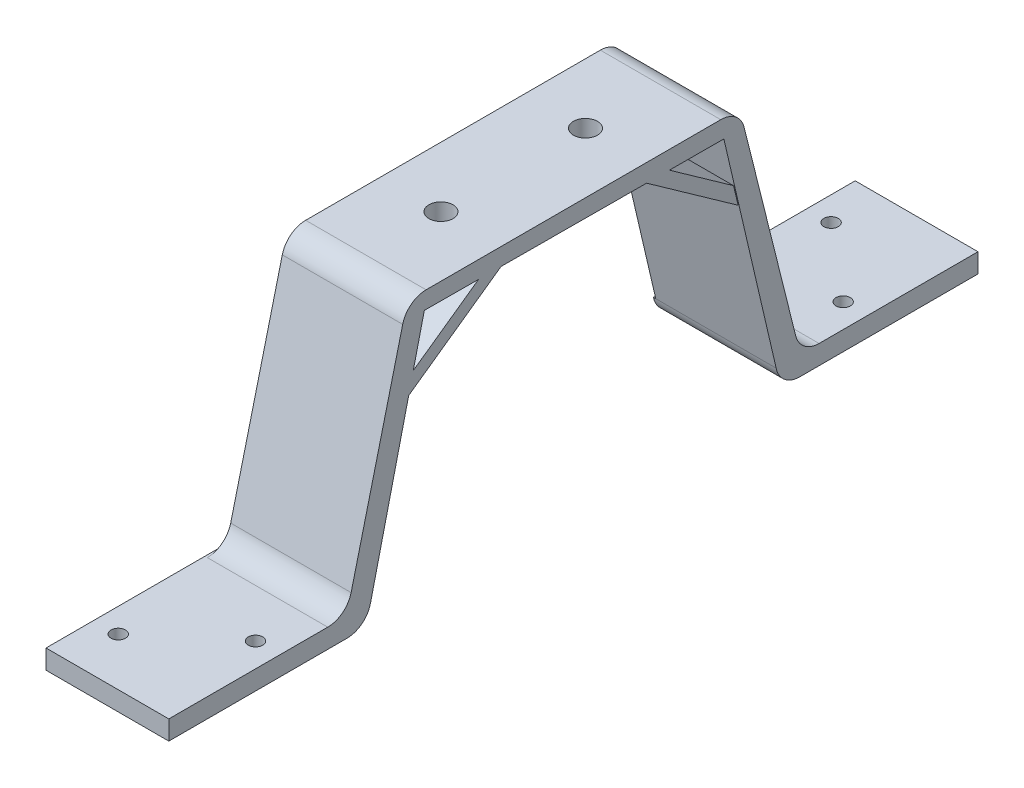
ISO-10303-21;
HEADER;
FILE_DESCRIPTION(('STEP AP214'),'2;1');
FILE_NAME('part.step','',(''),(''),'','','');
FILE_SCHEMA(('AUTOMOTIVE_DESIGN { 1 0 10303 214 1 1 1 1 }'));
ENDSEC;
DATA;
#1=APPLICATION_CONTEXT('core data for automotive mechanical design processes');
#2=APPLICATION_PROTOCOL_DEFINITION('international standard','automotive_design',2000,#1);
#3=PRODUCT_CONTEXT('',#1,'mechanical');
#4=PRODUCT('Part','Part','',(#3));
#5=PRODUCT_RELATED_PRODUCT_CATEGORY('part','',(#4));
#6=PRODUCT_DEFINITION_FORMATION('','',#4);
#7=PRODUCT_DEFINITION_CONTEXT('part definition',#1,'design');
#8=PRODUCT_DEFINITION('design','',#6,#7);
#9=PRODUCT_DEFINITION_SHAPE('','',#8);
#10=(LENGTH_UNIT() NAMED_UNIT(*) SI_UNIT(.MILLI.,.METRE.));
#11=(NAMED_UNIT(*) PLANE_ANGLE_UNIT() SI_UNIT($,.RADIAN.));
#12=(NAMED_UNIT(*) SI_UNIT($,.STERADIAN.) SOLID_ANGLE_UNIT());
#13=UNCERTAINTY_MEASURE_WITH_UNIT(LENGTH_MEASURE(1.E-05),#10,'distance_accuracy_value','');
#14=(GEOMETRIC_REPRESENTATION_CONTEXT(3) GLOBAL_UNCERTAINTY_ASSIGNED_CONTEXT((#13)) GLOBAL_UNIT_ASSIGNED_CONTEXT((#10,
#11,#12)) REPRESENTATION_CONTEXT('',''));
#15=CARTESIAN_POINT('',(0.,0.,0.));
#16=DIRECTION('',(0.,0.,1.));
#17=DIRECTION('',(1.,0.,0.));
#18=AXIS2_PLACEMENT_3D('',#15,#16,#17);
#19=CARTESIAN_POINT('',(25.5,4.,0.));
#20=DIRECTION('',(0.,-1.,0.));
#21=DIRECTION('',(0.,0.,-1.));
#22=AXIS2_PLACEMENT_3D('',#19,#20,#21);
#23=PLANE('',#22);
#24=CARTESIAN_POINT('',(20.5,3.99999999999998,145.004531802838));
#25=DIRECTION('',(0.,-1.,0.));
#26=DIRECTION('',(0.,0.,-1.));
#27=AXIS2_PLACEMENT_3D('',#24,#25,#26);
#28=CIRCLE('',#27,1.5);
#29=CARTESIAN_POINT('',(20.5,3.99999999999998,143.504531802838));
#30=VERTEX_POINT('',#29);
#31=EDGE_CURVE('E504',#30,#30,#28,.T.);
#32=ORIENTED_EDGE('',*,*,#31,.T.);
#33=EDGE_LOOP('',(#32));
#34=FACE_BOUND('',#33,.T.);
#35=CARTESIAN_POINT('',(5.,3.99999999999998,158.));
#36=DIRECTION('',(0.,-1.,0.));
#37=DIRECTION('',(0.,0.,-1.));
#38=AXIS2_PLACEMENT_3D('',#35,#36,#37);
#39=CIRCLE('',#38,1.49999999999999);
#40=CARTESIAN_POINT('',(5.,3.99999999999998,156.5));
#41=VERTEX_POINT('',#40);
#42=EDGE_CURVE('E500',#41,#41,#39,.T.);
#43=ORIENTED_EDGE('',*,*,#42,.T.);
#44=EDGE_LOOP('',(#43));
#45=FACE_BOUND('',#44,.T.);
#46=DIRECTION('',(0.,0.,1.));
#47=VECTOR('',#46,1.);
#48=CARTESIAN_POINT('',(25.5,4.,0.));
#49=LINE('',#48,#47);
#50=CARTESIAN_POINT('',(25.5,3.99999999999998,135.004531802838));
#51=VERTEX_POINT('',#50);
#52=CARTESIAN_POINT('',(25.5,3.99999999999998,168.));
#53=VERTEX_POINT('',#52);
#54=EDGE_CURVE('E368',#51,#53,#49,.T.);
#55=ORIENTED_EDGE('',*,*,#54,.F.);
#56=DIRECTION('',(1.,0.,0.));
#57=VECTOR('',#56,1.);
#58=CARTESIAN_POINT('',(0.499999999999997,3.99999999999998,135.004531802838));
#59=LINE('',#58,#57);
#60=CARTESIAN_POINT('',(0.499999999999997,3.99999999999998,135.004531802838));
#61=VERTEX_POINT('',#60);
#62=EDGE_CURVE('E441',#51,#61,#59,.F.);
#63=ORIENTED_EDGE('',*,*,#62,.T.);
#64=DIRECTION('',(0.,0.,-1.));
#65=VECTOR('',#64,1.);
#66=CARTESIAN_POINT('',(0.499999999999997,3.99999999999998,131.1));
#67=LINE('',#66,#65);
#68=CARTESIAN_POINT('',(0.499999999999997,3.99999999999998,126.1));
#69=VERTEX_POINT('',#68);
#70=EDGE_CURVE('E310',#61,#69,#67,.T.);
#71=ORIENTED_EDGE('',*,*,#70,.T.);
#72=DIRECTION('',(1.,0.,0.));
#73=VECTOR('',#72,1.);
#74=CARTESIAN_POINT('',(-0.5,3.99999999999998,126.1));
#75=LINE('',#74,#73);
#76=CARTESIAN_POINT('',(0.,3.99999999999998,126.1));
#77=VERTEX_POINT('',#76);
#78=EDGE_CURVE('E519',#77,#69,#75,.T.);
#79=ORIENTED_EDGE('',*,*,#78,.F.);
#80=DIRECTION('',(0.,0.,1.));
#81=VECTOR('',#80,1.);
#82=CARTESIAN_POINT('',(0.,4.,0.));
#83=LINE('',#82,#81);
#84=CARTESIAN_POINT('',(0.,3.99999999999998,168.));
#85=VERTEX_POINT('',#84);
#86=EDGE_CURVE('E386',#77,#85,#83,.T.);
#87=ORIENTED_EDGE('',*,*,#86,.T.);
#88=DIRECTION('',(-1.,0.,0.));
#89=VECTOR('',#88,1.);
#90=CARTESIAN_POINT('',(25.5,3.99999999999998,168.));
#91=LINE('',#90,#89);
#92=EDGE_CURVE('E405',#53,#85,#91,.T.);
#93=ORIENTED_EDGE('',*,*,#92,.F.);
#94=EDGE_LOOP('',(#55,#63,#71,#79,#87,#93));
#95=FACE_BOUND('',#94,.T.);
#96=ADVANCED_FACE('F42',(#34,#45,#95),#23,.F.);
#97=CARTESIAN_POINT('',(25.5,0.,0.));
#98=DIRECTION('',(0.,1.,0.));
#99=DIRECTION('',(0.,0.,1.));
#100=AXIS2_PLACEMENT_3D('',#97,#98,#99);
#101=PLANE('',#100);
#102=CARTESIAN_POINT('',(20.5,0.,145.004531802838));
#103=DIRECTION('',(0.,1.,0.));
#104=DIRECTION('',(0.,0.,1.));
#105=AXIS2_PLACEMENT_3D('',#102,#103,#104);
#106=CIRCLE('',#105,1.5);
#107=CARTESIAN_POINT('',(20.5,0.,146.504531802838));
#108=VERTEX_POINT('',#107);
#109=EDGE_CURVE('E501',#108,#108,#106,.T.);
#110=ORIENTED_EDGE('',*,*,#109,.T.);
#111=EDGE_LOOP('',(#110));
#112=FACE_BOUND('',#111,.T.);
#113=CARTESIAN_POINT('',(5.,0.,158.));
#114=DIRECTION('',(0.,1.,0.));
#115=DIRECTION('',(0.,0.,1.));
#116=AXIS2_PLACEMENT_3D('',#113,#114,#115);
#117=CIRCLE('',#116,1.49999999999999);
#118=CARTESIAN_POINT('',(5.,0.,159.5));
#119=VERTEX_POINT('',#118);
#120=EDGE_CURVE('E496',#119,#119,#117,.T.);
#121=ORIENTED_EDGE('',*,*,#120,.T.);
#122=EDGE_LOOP('',(#121));
#123=FACE_BOUND('',#122,.T.);
#124=DIRECTION('',(0.,0.,-1.));
#125=VECTOR('',#124,1.);
#126=CARTESIAN_POINT('',(0.,0.,0.));
#127=LINE('',#126,#125);
#128=CARTESIAN_POINT('',(0.,0.,168.));
#129=VERTEX_POINT('',#128);
#130=CARTESIAN_POINT('',(0.,0.,130.998979485566));
#131=VERTEX_POINT('',#130);
#132=EDGE_CURVE('E369',#129,#131,#127,.T.);
#133=ORIENTED_EDGE('',*,*,#132,.T.);
#134=DIRECTION('',(1.,0.,0.));
#135=VECTOR('',#134,1.);
#136=CARTESIAN_POINT('',(25.5,0.,130.998979485566));
#137=LINE('',#136,#135);
#138=CARTESIAN_POINT('',(25.5,0.,130.998979485566));
#139=VERTEX_POINT('',#138);
#140=EDGE_CURVE('E413',#131,#139,#137,.T.);
#141=ORIENTED_EDGE('',*,*,#140,.T.);
#142=DIRECTION('',(0.,0.,-1.));
#143=VECTOR('',#142,1.);
#144=CARTESIAN_POINT('',(25.5,0.,0.));
#145=LINE('',#144,#143);
#146=CARTESIAN_POINT('',(25.5,0.,168.));
#147=VERTEX_POINT('',#146);
#148=EDGE_CURVE('E378',#147,#139,#145,.T.);
#149=ORIENTED_EDGE('',*,*,#148,.F.);
#150=DIRECTION('',(-1.,0.,0.));
#151=VECTOR('',#150,1.);
#152=CARTESIAN_POINT('',(25.5,0.,168.));
#153=LINE('',#152,#151);
#154=EDGE_CURVE('E401',#147,#129,#153,.T.);
#155=ORIENTED_EDGE('',*,*,#154,.T.);
#156=EDGE_LOOP('',(#133,#141,#149,#155));
#157=FACE_BOUND('',#156,.T.);
#158=ADVANCED_FACE('F662',(#112,#123,#157),#101,.F.);
#159=CARTESIAN_POINT('',(0.,0.,0.));
#160=DIRECTION('',(1.,0.,0.));
#161=DIRECTION('',(0.,0.,-1.));
#162=AXIS2_PLACEMENT_3D('',#159,#160,#161);
#163=PLANE('',#162);
#164=ORIENTED_EDGE('',*,*,#86,.F.);
#165=CARTESIAN_POINT('',(0.,4.99999999999998,130.998979485566));
#166=DIRECTION('',(1.,0.,0.));
#167=DIRECTION('',(0.,0.,-1.));
#168=AXIS2_PLACEMENT_3D('',#165,#166,#167);
#169=CIRCLE('',#168,5.);
#170=EDGE_CURVE('E420',#77,#131,#169,.F.);
#171=ORIENTED_EDGE('',*,*,#170,.T.);
#172=ORIENTED_EDGE('',*,*,#132,.F.);
#173=DIRECTION('',(0.,-1.,0.));
#174=VECTOR('',#173,1.);
#175=CARTESIAN_POINT('',(0.,0.,168.));
#176=LINE('',#175,#174);
#177=EDGE_CURVE('E391',#85,#129,#176,.T.);
#178=ORIENTED_EDGE('',*,*,#177,.F.);
#179=EDGE_LOOP('',(#164,#171,#172,#178));
#180=FACE_BOUND('',#179,.T.);
#181=ADVANCED_FACE('F674',(#180),#163,.F.);
#182=CARTESIAN_POINT('',(0.499999999999997,50.9238936782228,114.950805331162));
#183=DIRECTION('',(0.,-0.999990946630495,0.00425519177550892));
#184=DIRECTION('',(0.,-0.00425519177550892,-0.999990946630495));
#185=AXIS2_PLACEMENT_3D('',#182,#183,#184);
#186=PLANE('',#185);
#187=CARTESIAN_POINT('',(13.,50.7283624190828,69.));
#188=DIRECTION('',(0.,-0.999990946630495,0.00425519177550892));
#189=DIRECTION('',(0.,0.00425519177550892,0.999990946630495));
#190=AXIS2_PLACEMENT_3D('',#187,#188,#189);
#191=ELLIPSE('',#190,2.50002263362867,2.5);
#192=CARTESIAN_POINT('',(15.4920486977899,50.7275146421288,68.800768255934));
#193=VERTEX_POINT('',#192);
#194=CARTESIAN_POINT('',(10.5079513022101,50.7275146421288,68.800768255934));
#195=VERTEX_POINT('',#194);
#196=EDGE_CURVE('E63',#193,#195,#191,.T.);
#197=ORIENTED_EDGE('',*,*,#196,.F.);
#198=DIRECTION('',(-1.,0.,0.));
#199=VECTOR('',#198,1.);
#200=CARTESIAN_POINT('',(0.499999999999997,50.7275146421288,68.800768255934));
#201=LINE('',#200,#199);
#202=CARTESIAN_POINT('',(25.5,50.7275146421288,68.800768255934));
#203=VERTEX_POINT('',#202);
#204=EDGE_CURVE('E241',#203,#193,#201,.T.);
#205=ORIENTED_EDGE('',*,*,#204,.F.);
#206=DIRECTION('',(0.,-0.00425519177550892,-0.999990946630495));
#207=VECTOR('',#206,1.);
#208=CARTESIAN_POINT('',(25.5,50.9238936782228,114.950805331162));
#209=LINE('',#208,#207);
#210=CARTESIAN_POINT('',(25.5,50.8560956628605,99.0179390495462));
#211=VERTEX_POINT('',#210);
#212=EDGE_CURVE('E347',#211,#203,#209,.T.);
#213=ORIENTED_EDGE('',*,*,#212,.F.);
#214=DIRECTION('',(1.,0.,0.));
#215=VECTOR('',#214,1.);
#216=CARTESIAN_POINT('',(0.499999999999997,50.8560956628605,99.0179390495462));
#217=LINE('',#216,#215);
#218=CARTESIAN_POINT('',(15.4999356372718,50.8560956628605,99.0179390495462));
#219=VERTEX_POINT('',#218);
#220=EDGE_CURVE('E280',#219,#211,#217,.T.);
#221=ORIENTED_EDGE('',*,*,#220,.F.);
#222=CARTESIAN_POINT('',(13.,50.8560193280733,99.));
#223=DIRECTION('',(0.,-0.999990946630495,0.00425519177550892));
#224=DIRECTION('',(0.,0.00425519177550892,0.999990946630495));
#225=AXIS2_PLACEMENT_3D('',#222,#223,#224);
#226=ELLIPSE('',#225,2.50002263362867,2.5);
#227=CARTESIAN_POINT('',(10.5000643627282,50.8560956628605,99.0179390495462));
#228=VERTEX_POINT('',#227);
#229=EDGE_CURVE('E56',#228,#219,#226,.T.);
#230=ORIENTED_EDGE('',*,*,#229,.F.);
#231=CARTESIAN_POINT('',(0.499999999999997,50.8560956628605,99.0179390495462));
#232=VERTEX_POINT('',#231);
#233=EDGE_CURVE('E275',#232,#228,#217,.T.);
#234=ORIENTED_EDGE('',*,*,#233,.F.);
#235=DIRECTION('',(0.,-0.00425519177550892,-0.999990946630495));
#236=VECTOR('',#235,1.);
#237=CARTESIAN_POINT('',(0.499999999999997,50.9238936782228,114.950805331162));
#238=LINE('',#237,#236);
#239=CARTESIAN_POINT('',(0.499999999999997,50.7275146421288,68.800768255934));
#240=VERTEX_POINT('',#239);
#241=EDGE_CURVE('E323',#232,#240,#238,.T.);
#242=ORIENTED_EDGE('',*,*,#241,.T.);
#243=EDGE_CURVE('E244',#195,#240,#201,.T.);
#244=ORIENTED_EDGE('',*,*,#243,.F.);
#245=EDGE_LOOP('',(#197,#205,#213,#221,#230,#234,#242,#244));
#246=FACE_BOUND('',#245,.T.);
#247=ADVANCED_FACE('F239',(#246),#186,.T.);
#248=DIRECTION('',(1.,0.,0.));
#249=VECTOR('',#248,1.);
#250=CARTESIAN_POINT('',(0.499999999999997,50.7074397662026,64.083073909822));
#251=LINE('',#250,#249);
#252=CARTESIAN_POINT('',(0.499999999999997,50.7074397662027,64.0830739098221));
#253=VERTEX_POINT('',#252);
#254=CARTESIAN_POINT('',(25.5,50.7074397662027,64.0830739098222));
#255=VERTEX_POINT('',#254);
#256=EDGE_CURVE('E259',#253,#255,#251,.T.);
#257=ORIENTED_EDGE('',*,*,#256,.F.);
#258=CARTESIAN_POINT('',(0.499999999999997,50.6592778388253,52.7647846550834));
#259=VERTEX_POINT('',#258);
#260=EDGE_CURVE('E318',#253,#259,#238,.T.);
#261=ORIENTED_EDGE('',*,*,#260,.T.);
#262=DIRECTION('',(1.,0.,0.));
#263=VECTOR('',#262,1.);
#264=CARTESIAN_POINT('',(0.499999999999997,50.6592778388253,52.7647846550834));
#265=LINE('',#264,#263);
#266=CARTESIAN_POINT('',(25.5,50.6592778388253,52.7647846550834));
#267=VERTEX_POINT('',#266);
#268=EDGE_CURVE('E348',#259,#267,#265,.T.);
#269=ORIENTED_EDGE('',*,*,#268,.T.);
#270=EDGE_CURVE('E343',#255,#267,#209,.T.);
#271=ORIENTED_EDGE('',*,*,#270,.F.);
#272=EDGE_LOOP('',(#257,#261,#269,#271));
#273=FACE_BOUND('',#272,.T.);
#274=ADVANCED_FACE('F567',(#273),#186,.T.);
#275=CARTESIAN_POINT('',(0.499999999999997,3.99999999999998,126.1));
#276=DIRECTION('',(0.,-0.231166048016753,-0.97291431187146));
#277=DIRECTION('',(0.,0.97291431187146,-0.231166048016753));
#278=AXIS2_PLACEMENT_3D('',#275,#276,#277);
#279=PLANE('',#278);
#280=DIRECTION('',(1.,0.,0.));
#281=VECTOR('',#280,1.);
#282=CARTESIAN_POINT('',(0.499999999999997,37.2517881460241,118.199320195608));
#283=LINE('',#282,#281);
#284=CARTESIAN_POINT('',(0.499999999999997,37.2517881460241,118.199320195608));
#285=VERTEX_POINT('',#284);
#286=CARTESIAN_POINT('',(25.5,37.2517881460241,118.199320195608));
#287=VERTEX_POINT('',#286);
#288=EDGE_CURVE('E281',#285,#287,#283,.T.);
#289=ORIENTED_EDGE('',*,*,#288,.T.);
#290=DIRECTION('',(0.,0.97291431187146,-0.231166048016753));
#291=VECTOR('',#290,1.);
#292=CARTESIAN_POINT('',(25.5,3.99999999999998,126.1));
#293=LINE('',#292,#291);
#294=CARTESIAN_POINT('',(25.5,3.99999999999998,126.1));
#295=VERTEX_POINT('',#294);
#296=EDGE_CURVE('E339',#295,#287,#293,.T.);
#297=ORIENTED_EDGE('',*,*,#296,.F.);
#298=DIRECTION('',(1.,0.,0.));
#299=VECTOR('',#298,1.);
#300=CARTESIAN_POINT('',(0.499999999999997,3.99999999999998,126.1));
#301=LINE('',#300,#299);
#302=EDGE_CURVE('E357',#69,#295,#301,.T.);
#303=ORIENTED_EDGE('',*,*,#302,.F.);
#304=DIRECTION('',(0.,0.97291431187146,-0.231166048016753));
#305=VECTOR('',#304,1.);
#306=CARTESIAN_POINT('',(0.499999999999997,3.99999999999998,126.1));
#307=LINE('',#306,#305);
#308=EDGE_CURVE('E315',#69,#285,#307,.T.);
#309=ORIENTED_EDGE('',*,*,#308,.T.);
#310=EDGE_LOOP('',(#289,#297,#303,#309));
#311=FACE_BOUND('',#310,.T.);
#312=ADVANCED_FACE('F670',(#311),#279,.T.);
#313=CARTESIAN_POINT('',(25.5,0.,0.));
#314=DIRECTION('',(0.,0.,1.));
#315=DIRECTION('',(1.,0.,0.));
#316=AXIS2_PLACEMENT_3D('',#313,#314,#315);
#317=PLANE('',#316);
#318=DIRECTION('',(0.,1.,0.));
#319=VECTOR('',#318,1.);
#320=CARTESIAN_POINT('',(0.,0.,0.));
#321=LINE('',#320,#319);
#322=CARTESIAN_POINT('',(0.,0.,0.));
#323=VERTEX_POINT('',#322);
#324=CARTESIAN_POINT('',(0.,4.,0.));
#325=VERTEX_POINT('',#324);
#326=EDGE_CURVE('E352',#323,#325,#321,.T.);
#327=ORIENTED_EDGE('',*,*,#326,.T.);
#328=DIRECTION('',(-1.,0.,0.));
#329=VECTOR('',#328,1.);
#330=CARTESIAN_POINT('',(25.5,4.,0.));
#331=LINE('',#330,#329);
#332=CARTESIAN_POINT('',(25.5,4.,0.));
#333=VERTEX_POINT('',#332);
#334=EDGE_CURVE('E409',#333,#325,#331,.T.);
#335=ORIENTED_EDGE('',*,*,#334,.F.);
#336=DIRECTION('',(0.,1.,0.));
#337=VECTOR('',#336,1.);
#338=CARTESIAN_POINT('',(25.5,0.,0.));
#339=LINE('',#338,#337);
#340=CARTESIAN_POINT('',(25.5,0.,0.));
#341=VERTEX_POINT('',#340);
#342=EDGE_CURVE('E364',#341,#333,#339,.T.);
#343=ORIENTED_EDGE('',*,*,#342,.F.);
#344=DIRECTION('',(-1.,0.,0.));
#345=VECTOR('',#344,1.);
#346=CARTESIAN_POINT('',(25.5,0.,0.));
#347=LINE('',#346,#345);
#348=EDGE_CURVE('E382',#341,#323,#347,.T.);
#349=ORIENTED_EDGE('',*,*,#348,.T.);
#350=EDGE_LOOP('',(#327,#335,#343,#349));
#351=FACE_BOUND('',#350,.T.);
#352=ADVANCED_FACE('F613',(#351),#317,.F.);
#353=CARTESIAN_POINT('',(5.,4.,10.));
#354=DIRECTION('',(0.,-1.,0.));
#355=DIRECTION('',(0.,0.,-1.));
#356=AXIS2_PLACEMENT_3D('',#353,#354,#355);
#357=CIRCLE('',#356,1.5);
#358=CARTESIAN_POINT('',(5.,4.,8.5));
#359=VERTEX_POINT('',#358);
#360=EDGE_CURVE('E495',#359,#359,#357,.T.);
#361=ORIENTED_EDGE('',*,*,#360,.T.);
#362=EDGE_LOOP('',(#361));
#363=FACE_BOUND('',#362,.T.);
#364=CARTESIAN_POINT('',(20.5,4.,22.9954681971617));
#365=DIRECTION('',(0.,-1.,0.));
#366=DIRECTION('',(0.,0.,-1.));
#367=AXIS2_PLACEMENT_3D('',#364,#365,#366);
#368=CIRCLE('',#367,1.5);
#369=CARTESIAN_POINT('',(20.5,4.,21.4954681971617));
#370=VERTEX_POINT('',#369);
#371=EDGE_CURVE('E490',#370,#370,#368,.T.);
#372=ORIENTED_EDGE('',*,*,#371,.T.);
#373=EDGE_LOOP('',(#372));
#374=FACE_BOUND('',#373,.T.);
#375=DIRECTION('',(0.,0.,-1.));
#376=VECTOR('',#375,1.);
#377=CARTESIAN_POINT('',(0.499999999999997,4.,41.9));
#378=LINE('',#377,#376);
#379=CARTESIAN_POINT('',(0.499999999999997,3.99999999999999,41.9));
#380=VERTEX_POINT('',#379);
#381=CARTESIAN_POINT('',(0.499999999999997,3.99999999999999,32.9954681971615));
#382=VERTEX_POINT('',#381);
#383=EDGE_CURVE('E294',#380,#382,#378,.T.);
#384=ORIENTED_EDGE('',*,*,#383,.T.);
#385=DIRECTION('',(1.,0.,0.));
#386=VECTOR('',#385,1.);
#387=CARTESIAN_POINT('',(25.5,3.99999999999999,32.9954681971615));
#388=LINE('',#387,#386);
#389=CARTESIAN_POINT('',(25.5,3.99999999999999,32.9954681971615));
#390=VERTEX_POINT('',#389);
#391=EDGE_CURVE('E423',#382,#390,#388,.T.);
#392=ORIENTED_EDGE('',*,*,#391,.T.);
#393=EDGE_CURVE('E370',#333,#390,#49,.T.);
#394=ORIENTED_EDGE('',*,*,#393,.F.);
#395=ORIENTED_EDGE('',*,*,#334,.T.);
#396=CARTESIAN_POINT('',(0.,3.99999999999999,41.9));
#397=VERTEX_POINT('',#396);
#398=EDGE_CURVE('E387',#325,#397,#83,.T.);
#399=ORIENTED_EDGE('',*,*,#398,.T.);
#400=DIRECTION('',(1.,0.,0.));
#401=VECTOR('',#400,1.);
#402=CARTESIAN_POINT('',(-0.5,3.99999999999999,41.9));
#403=LINE('',#402,#401);
#404=EDGE_CURVE('E510',#397,#380,#403,.T.);
#405=ORIENTED_EDGE('',*,*,#404,.T.);
#406=EDGE_LOOP('',(#384,#392,#394,#395,#399,#405));
#407=FACE_BOUND('',#406,.T.);
#408=ADVANCED_FACE('F615',(#363,#374,#407),#23,.F.);
#409=CARTESIAN_POINT('',(25.5,0.,168.));
#410=DIRECTION('',(0.,0.,-1.));
#411=DIRECTION('',(-1.,0.,0.));
#412=AXIS2_PLACEMENT_3D('',#409,#410,#411);
#413=PLANE('',#412);
#414=ORIENTED_EDGE('',*,*,#177,.T.);
#415=ORIENTED_EDGE('',*,*,#154,.F.);
#416=DIRECTION('',(0.,-1.,0.));
#417=VECTOR('',#416,1.);
#418=CARTESIAN_POINT('',(25.5,0.,168.));
#419=LINE('',#418,#417);
#420=EDGE_CURVE('E374',#53,#147,#419,.T.);
#421=ORIENTED_EDGE('',*,*,#420,.F.);
#422=ORIENTED_EDGE('',*,*,#92,.T.);
#423=EDGE_LOOP('',(#414,#415,#421,#422));
#424=FACE_BOUND('',#423,.T.);
#425=ADVANCED_FACE('F658',(#424),#413,.F.);
#426=CARTESIAN_POINT('',(5.,0.,10.));
#427=DIRECTION('',(0.,1.,0.));
#428=DIRECTION('',(0.,0.,1.));
#429=AXIS2_PLACEMENT_3D('',#426,#427,#428);
#430=CIRCLE('',#429,1.5);
#431=CARTESIAN_POINT('',(5.,0.,11.5));
#432=VERTEX_POINT('',#431);
#433=EDGE_CURVE('E491',#432,#432,#430,.T.);
#434=ORIENTED_EDGE('',*,*,#433,.T.);
#435=EDGE_LOOP('',(#434));
#436=FACE_BOUND('',#435,.T.);
#437=CARTESIAN_POINT('',(20.5,0.,22.9954681971617));
#438=DIRECTION('',(0.,1.,0.));
#439=DIRECTION('',(0.,0.,1.));
#440=AXIS2_PLACEMENT_3D('',#437,#438,#439);
#441=CIRCLE('',#440,1.5);
#442=CARTESIAN_POINT('',(20.5,0.,24.4954681971617));
#443=VERTEX_POINT('',#442);
#444=EDGE_CURVE('E486',#443,#443,#441,.T.);
#445=ORIENTED_EDGE('',*,*,#444,.T.);
#446=EDGE_LOOP('',(#445));
#447=FACE_BOUND('',#446,.T.);
#448=CARTESIAN_POINT('',(25.5,0.,37.0010205144336));
#449=VERTEX_POINT('',#448);
#450=EDGE_CURVE('E377',#449,#341,#145,.T.);
#451=ORIENTED_EDGE('',*,*,#450,.F.);
#452=DIRECTION('',(-1.,0.,0.));
#453=VECTOR('',#452,1.);
#454=CARTESIAN_POINT('',(25.5,0.,37.0010205144336));
#455=LINE('',#454,#453);
#456=CARTESIAN_POINT('',(0.,0.,37.0010205144336));
#457=VERTEX_POINT('',#456);
#458=EDGE_CURVE('E467',#449,#457,#455,.T.);
#459=ORIENTED_EDGE('',*,*,#458,.T.);
#460=EDGE_CURVE('E394',#457,#323,#127,.T.);
#461=ORIENTED_EDGE('',*,*,#460,.T.);
#462=ORIENTED_EDGE('',*,*,#348,.F.);
#463=EDGE_LOOP('',(#451,#459,#461,#462));
#464=FACE_BOUND('',#463,.T.);
#465=ADVANCED_FACE('F609',(#436,#447,#464),#101,.F.);
#466=CARTESIAN_POINT('',(25.5,0.,0.));
#467=DIRECTION('',(1.,0.,0.));
#468=DIRECTION('',(0.,0.,-1.));
#469=AXIS2_PLACEMENT_3D('',#466,#467,#468);
#470=PLANE('',#469);
#471=DIRECTION('',(0.,0.970181647907409,0.242378980243057));
#472=VECTOR('',#471,1.);
#473=CARTESIAN_POINT('',(25.5,3.99999999999999,36.9));
#474=LINE('',#473,#472);
#475=CARTESIAN_POINT('',(25.5,7.78810509878471,37.8463764366986));
#476=VERTEX_POINT('',#475);
#477=CARTESIAN_POINT('',(25.5,50.6613405924005,48.5573305359404));
#478=VERTEX_POINT('',#477);
#479=EDGE_CURVE('E326',#476,#478,#474,.T.);
#480=ORIENTED_EDGE('',*,*,#479,.T.);
#481=CARTESIAN_POINT('',(25.5,49.4494456911853,53.4082387754774));
#482=DIRECTION('',(1.,0.,0.));
#483=DIRECTION('',(0.,0.,-1.));
#484=AXIS2_PLACEMENT_3D('',#481,#482,#483);
#485=CIRCLE('',#484,5.);
#486=CARTESIAN_POINT('',(25.5,54.4494456911853,53.4082387754774));
#487=VERTEX_POINT('',#486);
#488=EDGE_CURVE('E451',#478,#487,#485,.T.);
#489=ORIENTED_EDGE('',*,*,#488,.T.);
#490=DIRECTION('',(0.,0.,-1.));
#491=VECTOR('',#490,1.);
#492=CARTESIAN_POINT('',(25.5,54.4494456911853,118.496293027361));
#493=LINE('',#492,#491);
#494=CARTESIAN_POINT('',(25.5,54.4494456911853,114.591761224523));
#495=VERTEX_POINT('',#494);
#496=EDGE_CURVE('E330',#495,#487,#493,.T.);
#497=ORIENTED_EDGE('',*,*,#496,.F.);
#498=CARTESIAN_POINT('',(25.5,49.4494456911853,114.591761224523));
#499=DIRECTION('',(1.,0.,0.));
#500=DIRECTION('',(0.,0.,-1.));
#501=AXIS2_PLACEMENT_3D('',#498,#499,#500);
#502=CIRCLE('',#501,5.);
#503=CARTESIAN_POINT('',(25.5,50.6613405924005,119.44266946406));
#504=VERTEX_POINT('',#503);
#505=EDGE_CURVE('E448',#495,#504,#502,.T.);
#506=ORIENTED_EDGE('',*,*,#505,.T.);
#507=DIRECTION('',(0.,0.970181647907409,-0.242378980243056));
#508=VECTOR('',#507,1.);
#509=CARTESIAN_POINT('',(25.5,3.99999999999998,131.1));
#510=LINE('',#509,#508);
#511=CARTESIAN_POINT('',(25.5,7.78810509878469,130.153623563301));
#512=VERTEX_POINT('',#511);
#513=EDGE_CURVE('E334',#512,#504,#510,.T.);
#514=ORIENTED_EDGE('',*,*,#513,.F.);
#515=CARTESIAN_POINT('',(25.5,8.99999999999998,135.004531802838));
#516=DIRECTION('',(1.,0.,0.));
#517=DIRECTION('',(0.,0.,-1.));
#518=AXIS2_PLACEMENT_3D('',#515,#516,#517);
#519=CIRCLE('',#518,5.);
#520=EDGE_CURVE('E481',#512,#51,#519,.F.);
#521=ORIENTED_EDGE('',*,*,#520,.T.);
#522=ORIENTED_EDGE('',*,*,#54,.T.);
#523=ORIENTED_EDGE('',*,*,#420,.T.);
#524=ORIENTED_EDGE('',*,*,#148,.T.);
#525=CARTESIAN_POINT('',(25.5,4.99999999999998,130.998979485566));
#526=DIRECTION('',(1.,0.,0.));
#527=DIRECTION('',(0.,0.,-1.));
#528=AXIS2_PLACEMENT_3D('',#525,#526,#527);
#529=CIRCLE('',#528,5.);
#530=EDGE_CURVE('E417',#139,#295,#529,.T.);
#531=ORIENTED_EDGE('',*,*,#530,.T.);
#532=ORIENTED_EDGE('',*,*,#296,.T.);
#533=DIRECTION('',(0.,0.57851265978945,-0.815673404288344));
#534=VECTOR('',#533,1.);
#535=CARTESIAN_POINT('',(25.5,37.2517881460241,118.199320195608));
#536=LINE('',#535,#534);
#537=EDGE_CURVE('E257',#287,#211,#536,.T.);
#538=ORIENTED_EDGE('',*,*,#537,.T.);
#539=ORIENTED_EDGE('',*,*,#212,.T.);
#540=DIRECTION('',(0.,-0.57851265978945,-0.815673404288344));
#541=VECTOR('',#540,1.);
#542=CARTESIAN_POINT('',(25.5,37.2517881460241,49.8006798043919));
#543=LINE('',#542,#541);
#544=CARTESIAN_POINT('',(25.5,37.2517881460241,49.8006798043919));
#545=VERTEX_POINT('',#544);
#546=EDGE_CURVE('E250',#203,#545,#543,.T.);
#547=ORIENTED_EDGE('',*,*,#546,.T.);
#548=DIRECTION('',(0.,0.97291431187146,0.231166048016751));
#549=VECTOR('',#548,1.);
#550=CARTESIAN_POINT('',(25.5,41.2517881460241,50.7510864134677));
#551=LINE('',#550,#549);
#552=CARTESIAN_POINT('',(25.5,41.2517881460241,50.7510864134677));
#553=VERTEX_POINT('',#552);
#554=EDGE_CURVE('E538',#545,#553,#551,.T.);
#555=ORIENTED_EDGE('',*,*,#554,.T.);
#556=DIRECTION('',(0.,0.578512659789449,0.815673404288344));
#557=VECTOR('',#556,1.);
#558=CARTESIAN_POINT('',(25.5,50.8759310906086,64.3206381011075));
#559=LINE('',#558,#557);
#560=EDGE_CURVE('E534',#553,#255,#559,.T.);
#561=ORIENTED_EDGE('',*,*,#560,.T.);
#562=ORIENTED_EDGE('',*,*,#270,.T.);
#563=DIRECTION('',(0.,-0.9739444833018,-0.226786559226929));
#564=VECTOR('',#563,1.);
#565=CARTESIAN_POINT('',(25.5,50.6592778388253,52.7647846550834));
#566=LINE('',#565,#564);
#567=CARTESIAN_POINT('',(25.5,3.99999999999999,41.9));
#568=VERTEX_POINT('',#567);
#569=EDGE_CURVE('E279',#267,#568,#566,.T.);
#570=ORIENTED_EDGE('',*,*,#569,.T.);
#571=CARTESIAN_POINT('',(25.5,5.,37.0010205144336));
#572=DIRECTION('',(1.,0.,0.));
#573=DIRECTION('',(0.,0.,-1.));
#574=AXIS2_PLACEMENT_3D('',#571,#572,#573);
#575=CIRCLE('',#574,5.);
#576=EDGE_CURVE('E445',#568,#449,#575,.T.);
#577=ORIENTED_EDGE('',*,*,#576,.T.);
#578=ORIENTED_EDGE('',*,*,#450,.T.);
#579=ORIENTED_EDGE('',*,*,#342,.T.);
#580=ORIENTED_EDGE('',*,*,#393,.T.);
#581=CARTESIAN_POINT('',(25.5,8.99999999999999,32.9954681971615));
#582=DIRECTION('',(1.,0.,0.));
#583=DIRECTION('',(0.,0.,-1.));
#584=AXIS2_PLACEMENT_3D('',#581,#582,#583);
#585=CIRCLE('',#584,5.);
#586=EDGE_CURVE('E474',#390,#476,#585,.F.);
#587=ORIENTED_EDGE('',*,*,#586,.T.);
#588=EDGE_LOOP('',(#480,#489,#497,#506,#514,#521,#522,#523,#524,#531,#532,#538,#539,#547,#555,
#561,#562,#570,#577,#578,#579,#580,#587));
#589=FACE_BOUND('',#588,.T.);
#590=CARTESIAN_POINT('',(25.5,50.9238936782228,114.950805331162));
#591=VERTEX_POINT('',#590);
#592=CARTESIAN_POINT('',(25.5,50.8759310906086,103.679361898893));
#593=VERTEX_POINT('',#592);
#594=EDGE_CURVE('E295',#591,#593,#209,.T.);
#595=ORIENTED_EDGE('',*,*,#594,.T.);
#596=DIRECTION('',(0.,-0.578512659789449,0.815673404288344));
#597=VECTOR('',#596,1.);
#598=CARTESIAN_POINT('',(25.5,50.8759310906086,103.679361898893));
#599=LINE('',#598,#597);
#600=CARTESIAN_POINT('',(25.5,41.2517881460241,117.248913586532));
#601=VERTEX_POINT('',#600);
#602=EDGE_CURVE('E252',#593,#601,#599,.T.);
#603=ORIENTED_EDGE('',*,*,#602,.T.);
#604=EDGE_CURVE('E338',#601,#591,#293,.T.);
#605=ORIENTED_EDGE('',*,*,#604,.T.);
#606=EDGE_LOOP('',(#595,#603,#605));
#607=FACE_BOUND('',#606,.T.);
#608=ADVANCED_FACE('F574',(#589,#607),#470,.T.);
#609=ORIENTED_EDGE('',*,*,#460,.F.);
#610=CARTESIAN_POINT('',(0.,5.,37.0010205144336));
#611=DIRECTION('',(1.,0.,0.));
#612=DIRECTION('',(0.,0.,-1.));
#613=AXIS2_PLACEMENT_3D('',#610,#611,#612);
#614=CIRCLE('',#613,5.);
#615=EDGE_CURVE('E471',#457,#397,#614,.F.);
#616=ORIENTED_EDGE('',*,*,#615,.T.);
#617=ORIENTED_EDGE('',*,*,#398,.F.);
#618=ORIENTED_EDGE('',*,*,#326,.F.);
#619=EDGE_LOOP('',(#609,#616,#617,#618));
#620=FACE_BOUND('',#619,.T.);
#621=ADVANCED_FACE('F677',(#620),#163,.F.);
#622=CARTESIAN_POINT('',(0.499999999999997,50.6592778388253,52.7647846550834));
#623=DIRECTION('',(0.,-0.226786559226929,0.9739444833018));
#624=DIRECTION('',(0.,-0.9739444833018,-0.226786559226929));
#625=AXIS2_PLACEMENT_3D('',#622,#623,#624);
#626=PLANE('',#625);
#627=ORIENTED_EDGE('',*,*,#569,.F.);
#628=ORIENTED_EDGE('',*,*,#268,.F.);
#629=DIRECTION('',(0.,-0.9739444833018,-0.226786559226929));
#630=VECTOR('',#629,1.);
#631=CARTESIAN_POINT('',(0.499999999999997,50.6592778388253,52.7647846550834));
#632=LINE('',#631,#630);
#633=EDGE_CURVE('E290',#259,#380,#632,.T.);
#634=ORIENTED_EDGE('',*,*,#633,.T.);
#635=DIRECTION('',(1.,0.,0.));
#636=VECTOR('',#635,1.);
#637=CARTESIAN_POINT('',(0.499999999999997,4.,41.9));
#638=LINE('',#637,#636);
#639=EDGE_CURVE('E322',#380,#568,#638,.T.);
#640=ORIENTED_EDGE('',*,*,#639,.T.);
#641=EDGE_LOOP('',(#627,#628,#634,#640));
#642=FACE_BOUND('',#641,.T.);
#643=ADVANCED_FACE('F687',(#642),#626,.T.);
#644=DIRECTION('',(1.,0.,0.));
#645=VECTOR('',#644,1.);
#646=CARTESIAN_POINT('',(0.499999999999997,50.8759310906086,103.679361898893));
#647=LINE('',#646,#645);
#648=CARTESIAN_POINT('',(0.499999999999997,50.8759310906086,103.679361898893));
#649=VERTEX_POINT('',#648);
#650=EDGE_CURVE('E270',#649,#593,#647,.T.);
#651=ORIENTED_EDGE('',*,*,#650,.T.);
#652=ORIENTED_EDGE('',*,*,#594,.F.);
#653=DIRECTION('',(1.,0.,0.));
#654=VECTOR('',#653,1.);
#655=CARTESIAN_POINT('',(0.499999999999997,50.9238936782228,114.950805331162));
#656=LINE('',#655,#654);
#657=CARTESIAN_POINT('',(0.499999999999997,50.9238936782228,114.950805331162));
#658=VERTEX_POINT('',#657);
#659=EDGE_CURVE('E353',#658,#591,#656,.T.);
#660=ORIENTED_EDGE('',*,*,#659,.F.);
#661=EDGE_CURVE('E319',#658,#649,#238,.T.);
#662=ORIENTED_EDGE('',*,*,#661,.T.);
#663=EDGE_LOOP('',(#651,#652,#660,#662));
#664=FACE_BOUND('',#663,.T.);
#665=ADVANCED_FACE('F590',(#664),#186,.T.);
#666=DIRECTION('',(1.,0.,0.));
#667=VECTOR('',#666,1.);
#668=CARTESIAN_POINT('',(0.499999999999997,41.2517881460241,117.248913586532));
#669=LINE('',#668,#667);
#670=CARTESIAN_POINT('',(0.499999999999997,41.2517881460241,117.248913586532));
#671=VERTEX_POINT('',#670);
#672=EDGE_CURVE('E284',#671,#601,#669,.T.);
#673=ORIENTED_EDGE('',*,*,#672,.F.);
#674=EDGE_CURVE('E314',#671,#658,#307,.T.);
#675=ORIENTED_EDGE('',*,*,#674,.T.);
#676=ORIENTED_EDGE('',*,*,#659,.T.);
#677=ORIENTED_EDGE('',*,*,#604,.F.);
#678=EDGE_LOOP('',(#673,#675,#676,#677));
#679=FACE_BOUND('',#678,.T.);
#680=ADVANCED_FACE('F587',(#679),#279,.T.);
#681=CARTESIAN_POINT('',(0.499999999999997,3.99999999999998,131.1));
#682=DIRECTION('',(0.,-0.242378980243056,-0.970181647907409));
#683=DIRECTION('',(0.,0.970181647907409,-0.242378980243056));
#684=AXIS2_PLACEMENT_3D('',#681,#682,#683);
#685=PLANE('',#684);
#686=DIRECTION('',(0.,0.970181647907409,-0.242378980243056));
#687=VECTOR('',#686,1.);
#688=CARTESIAN_POINT('',(0.499999999999997,3.99999999999998,131.1));
#689=LINE('',#688,#687);
#690=CARTESIAN_POINT('',(0.499999999999997,7.78810509878469,130.153623563301));
#691=VERTEX_POINT('',#690);
#692=CARTESIAN_POINT('',(0.499999999999997,50.6613405924005,119.44266946406));
#693=VERTEX_POINT('',#692);
#694=EDGE_CURVE('E306',#691,#693,#689,.T.);
#695=ORIENTED_EDGE('',*,*,#694,.F.);
#696=DIRECTION('',(1.,0.,0.));
#697=VECTOR('',#696,1.);
#698=CARTESIAN_POINT('',(25.5,7.7881050987847,130.153623563301));
#699=LINE('',#698,#697);
#700=EDGE_CURVE('E437',#691,#512,#699,.T.);
#701=ORIENTED_EDGE('',*,*,#700,.T.);
#702=ORIENTED_EDGE('',*,*,#513,.T.);
#703=DIRECTION('',(1.,0.,0.));
#704=VECTOR('',#703,1.);
#705=CARTESIAN_POINT('',(0.499999999999997,50.6613405924005,119.44266946406));
#706=LINE('',#705,#704);
#707=EDGE_CURVE('E434',#504,#693,#706,.F.);
#708=ORIENTED_EDGE('',*,*,#707,.T.);
#709=EDGE_LOOP('',(#695,#701,#702,#708));
#710=FACE_BOUND('',#709,.T.);
#711=ADVANCED_FACE('F644',(#710),#685,.F.);
#712=CARTESIAN_POINT('',(0.499999999999997,54.4494456911853,118.496293027361));
#713=DIRECTION('',(0.,-1.,0.));
#714=DIRECTION('',(0.,0.,-1.));
#715=AXIS2_PLACEMENT_3D('',#712,#713,#714);
#716=PLANE('',#715);
#717=CARTESIAN_POINT('',(13.,54.4494456911853,69.));
#718=DIRECTION('',(0.,1.,0.));
#719=DIRECTION('',(0.,0.,1.));
#720=AXIS2_PLACEMENT_3D('',#717,#718,#719);
#721=CIRCLE('',#720,2.5);
#722=CARTESIAN_POINT('',(13.,54.4494456911853,71.5));
#723=VERTEX_POINT('',#722);
#724=EDGE_CURVE('E246',#723,#723,#721,.T.);
#725=ORIENTED_EDGE('',*,*,#724,.F.);
#726=EDGE_LOOP('',(#725));
#727=FACE_BOUND('',#726,.T.);
#728=CARTESIAN_POINT('',(13.,54.4494456911853,99.));
#729=DIRECTION('',(0.,1.,0.));
#730=DIRECTION('',(0.,0.,-1.));
#731=AXIS2_PLACEMENT_3D('',#728,#729,#730);
#732=CIRCLE('',#731,2.5);
#733=CARTESIAN_POINT('',(13.,54.4494456911853,96.5));
#734=VERTEX_POINT('',#733);
#735=EDGE_CURVE('E712',#734,#734,#732,.T.);
#736=ORIENTED_EDGE('',*,*,#735,.F.);
#737=EDGE_LOOP('',(#736));
#738=FACE_BOUND('',#737,.T.);
#739=ORIENTED_EDGE('',*,*,#496,.T.);
#740=DIRECTION('',(1.,0.,0.));
#741=VECTOR('',#740,1.);
#742=CARTESIAN_POINT('',(0.499999999999997,54.4494456911853,53.4082387754774));
#743=LINE('',#742,#741);
#744=CARTESIAN_POINT('',(0.499999999999997,54.4494456911853,53.4082387754774));
#745=VERTEX_POINT('',#744);
#746=EDGE_CURVE('E458',#487,#745,#743,.F.);
#747=ORIENTED_EDGE('',*,*,#746,.T.);
#748=DIRECTION('',(0.,0.,-1.));
#749=VECTOR('',#748,1.);
#750=CARTESIAN_POINT('',(0.499999999999997,54.4494456911853,118.496293027361));
#751=LINE('',#750,#749);
#752=CARTESIAN_POINT('',(0.499999999999997,54.4494456911853,114.591761224523));
#753=VERTEX_POINT('',#752);
#754=EDGE_CURVE('E302',#753,#745,#751,.T.);
#755=ORIENTED_EDGE('',*,*,#754,.F.);
#756=DIRECTION('',(1.,0.,0.));
#757=VECTOR('',#756,1.);
#758=CARTESIAN_POINT('',(0.499999999999997,54.4494456911853,114.591761224523));
#759=LINE('',#758,#757);
#760=EDGE_CURVE('E454',#753,#495,#759,.T.);
#761=ORIENTED_EDGE('',*,*,#760,.T.);
#762=EDGE_LOOP('',(#739,#747,#755,#761));
#763=FACE_BOUND('',#762,.T.);
#764=ADVANCED_FACE('F634',(#727,#738,#763),#716,.F.);
#765=CARTESIAN_POINT('',(0.499999999999997,3.99999999999999,36.9));
#766=DIRECTION('',(0.,0.242378980243057,-0.970181647907409));
#767=DIRECTION('',(0.,0.970181647907409,0.242378980243057));
#768=AXIS2_PLACEMENT_3D('',#765,#766,#767);
#769=PLANE('',#768);
#770=ORIENTED_EDGE('',*,*,#479,.F.);
#771=DIRECTION('',(1.,0.,0.));
#772=VECTOR('',#771,1.);
#773=CARTESIAN_POINT('',(0.499999999999997,7.78810509878471,37.8463764366986));
#774=LINE('',#773,#772);
#775=CARTESIAN_POINT('',(0.499999999999997,7.78810509878471,37.8463764366986));
#776=VERTEX_POINT('',#775);
#777=EDGE_CURVE('E431',#476,#776,#774,.F.);
#778=ORIENTED_EDGE('',*,*,#777,.T.);
#779=DIRECTION('',(0.,0.970181647907409,0.242378980243057));
#780=VECTOR('',#779,1.);
#781=CARTESIAN_POINT('',(0.499999999999997,3.99999999999999,36.9));
#782=LINE('',#781,#780);
#783=CARTESIAN_POINT('',(0.499999999999997,50.6613405924005,48.5573305359404));
#784=VERTEX_POINT('',#783);
#785=EDGE_CURVE('E298',#776,#784,#782,.T.);
#786=ORIENTED_EDGE('',*,*,#785,.T.);
#787=DIRECTION('',(1.,0.,0.));
#788=VECTOR('',#787,1.);
#789=CARTESIAN_POINT('',(25.5,50.6613405924005,48.5573305359404));
#790=LINE('',#789,#788);
#791=EDGE_CURVE('E427',#784,#478,#790,.T.);
#792=ORIENTED_EDGE('',*,*,#791,.T.);
#793=EDGE_LOOP('',(#770,#778,#786,#792));
#794=FACE_BOUND('',#793,.T.);
#795=ADVANCED_FACE('F622',(#794),#769,.T.);
#796=CARTESIAN_POINT('',(0.499999999999997,0.,0.));
#797=DIRECTION('',(1.,0.,0.));
#798=DIRECTION('',(0.,0.,-1.));
#799=AXIS2_PLACEMENT_3D('',#796,#797,#798);
#800=PLANE('',#799);
#801=ORIENTED_EDGE('',*,*,#754,.T.);
#802=CARTESIAN_POINT('',(0.499999999999997,49.4494456911853,53.4082387754774));
#803=DIRECTION('',(1.,0.,0.));
#804=DIRECTION('',(0.,0.,-1.));
#805=AXIS2_PLACEMENT_3D('',#802,#803,#804);
#806=CIRCLE('',#805,5.);
#807=EDGE_CURVE('E464',#745,#784,#806,.F.);
#808=ORIENTED_EDGE('',*,*,#807,.T.);
#809=ORIENTED_EDGE('',*,*,#785,.F.);
#810=CARTESIAN_POINT('',(0.499999999999997,8.99999999999999,32.9954681971615));
#811=DIRECTION('',(1.,0.,0.));
#812=DIRECTION('',(0.,0.,-1.));
#813=AXIS2_PLACEMENT_3D('',#810,#811,#812);
#814=CIRCLE('',#813,5.);
#815=EDGE_CURVE('E477',#776,#382,#814,.T.);
#816=ORIENTED_EDGE('',*,*,#815,.T.);
#817=ORIENTED_EDGE('',*,*,#383,.F.);
#818=ORIENTED_EDGE('',*,*,#633,.F.);
#819=ORIENTED_EDGE('',*,*,#260,.F.);
#820=DIRECTION('',(0.,0.578512659789449,0.815673404288344));
#821=VECTOR('',#820,1.);
#822=CARTESIAN_POINT('',(0.499999999999997,50.8759310906086,64.3206381011075));
#823=LINE('',#822,#821);
#824=CARTESIAN_POINT('',(0.499999999999997,41.2517881460241,50.7510864134677));
#825=VERTEX_POINT('',#824);
#826=EDGE_CURVE('E544',#825,#253,#823,.T.);
#827=ORIENTED_EDGE('',*,*,#826,.F.);
#828=DIRECTION('',(0.,0.97291431187146,0.231166048016751));
#829=VECTOR('',#828,1.);
#830=CARTESIAN_POINT('',(0.499999999999997,41.2517881460241,50.7510864134677));
#831=LINE('',#830,#829);
#832=CARTESIAN_POINT('',(0.499999999999997,37.2517881460241,49.8006798043919));
#833=VERTEX_POINT('',#832);
#834=EDGE_CURVE('E535',#833,#825,#831,.T.);
#835=ORIENTED_EDGE('',*,*,#834,.F.);
#836=DIRECTION('',(0.,-0.57851265978945,-0.815673404288344));
#837=VECTOR('',#836,1.);
#838=CARTESIAN_POINT('',(0.499999999999997,37.2517881460241,49.8006798043919));
#839=LINE('',#838,#837);
#840=EDGE_CURVE('E529',#240,#833,#839,.T.);
#841=ORIENTED_EDGE('',*,*,#840,.F.);
#842=ORIENTED_EDGE('',*,*,#241,.F.);
#843=DIRECTION('',(0.,0.57851265978945,-0.815673404288344));
#844=VECTOR('',#843,1.);
#845=CARTESIAN_POINT('',(0.499999999999997,37.2517881460241,118.199320195608));
#846=LINE('',#845,#844);
#847=EDGE_CURVE('E267',#285,#232,#846,.T.);
#848=ORIENTED_EDGE('',*,*,#847,.F.);
#849=ORIENTED_EDGE('',*,*,#308,.F.);
#850=ORIENTED_EDGE('',*,*,#70,.F.);
#851=CARTESIAN_POINT('',(0.499999999999997,8.99999999999998,135.004531802838));
#852=DIRECTION('',(1.,0.,0.));
#853=DIRECTION('',(0.,0.,-1.));
#854=AXIS2_PLACEMENT_3D('',#851,#852,#853);
#855=CIRCLE('',#854,5.);
#856=EDGE_CURVE('E236',#61,#691,#855,.T.);
#857=ORIENTED_EDGE('',*,*,#856,.T.);
#858=ORIENTED_EDGE('',*,*,#694,.T.);
#859=CARTESIAN_POINT('',(0.499999999999997,49.4494456911853,114.591761224523));
#860=DIRECTION('',(1.,0.,0.));
#861=DIRECTION('',(0.,0.,-1.));
#862=AXIS2_PLACEMENT_3D('',#859,#860,#861);
#863=CIRCLE('',#862,5.);
#864=EDGE_CURVE('E461',#693,#753,#863,.F.);
#865=ORIENTED_EDGE('',*,*,#864,.T.);
#866=EDGE_LOOP('',(#801,#808,#809,#816,#817,#818,#819,#827,#835,#841,#842,#848,#849,#850,#857,
#858,#865));
#867=FACE_BOUND('',#866,.T.);
#868=DIRECTION('',(0.,-0.578512659789449,0.815673404288344));
#869=VECTOR('',#868,1.);
#870=CARTESIAN_POINT('',(0.499999999999997,50.8759310906086,103.679361898893));
#871=LINE('',#870,#869);
#872=EDGE_CURVE('E263',#649,#671,#871,.T.);
#873=ORIENTED_EDGE('',*,*,#872,.F.);
#874=ORIENTED_EDGE('',*,*,#661,.F.);
#875=ORIENTED_EDGE('',*,*,#674,.F.);
#876=EDGE_LOOP('',(#873,#874,#875));
#877=FACE_BOUND('',#876,.T.);
#878=ADVANCED_FACE('F557',(#867,#877),#800,.F.);
#879=CARTESIAN_POINT('',(0.499999999999997,37.2517881460241,118.199320195608));
#880=DIRECTION('',(0.,-0.815673404288344,-0.578512659789449));
#881=DIRECTION('',(0.,0.578512659789449,-0.815673404288344));
#882=AXIS2_PLACEMENT_3D('',#879,#880,#881);
#883=PLANE('',#882);
#884=CARTESIAN_POINT('',(13.,50.8688188523288,99.));
#885=DIRECTION('',(0.,-0.815673404288344,-0.578512659789449));
#886=DIRECTION('',(0.,0.578512659789449,-0.815673404288344));
#887=AXIS2_PLACEMENT_3D('',#884,#885,#886);
#888=ELLIPSE('',#887,3.06495220618501,2.5);
#889=EDGE_CURVE('E11',#219,#228,#888,.T.);
#890=ORIENTED_EDGE('',*,*,#889,.F.);
#891=ORIENTED_EDGE('',*,*,#220,.T.);
#892=ORIENTED_EDGE('',*,*,#537,.F.);
#893=ORIENTED_EDGE('',*,*,#288,.F.);
#894=ORIENTED_EDGE('',*,*,#847,.T.);
#895=ORIENTED_EDGE('',*,*,#233,.T.);
#896=EDGE_LOOP('',(#890,#891,#892,#893,#894,#895));
#897=FACE_BOUND('',#896,.T.);
#898=ADVANCED_FACE('F755',(#897),#883,.T.);
#899=CARTESIAN_POINT('',(0.499999999999997,50.8759310906086,103.679361898893));
#900=DIRECTION('',(0.,0.815673404288345,0.578512659789449));
#901=DIRECTION('',(0.,-0.578512659789449,0.815673404288345));
#902=AXIS2_PLACEMENT_3D('',#899,#900,#901);
#903=PLANE('',#902);
#904=ORIENTED_EDGE('',*,*,#602,.F.);
#905=ORIENTED_EDGE('',*,*,#650,.F.);
#906=ORIENTED_EDGE('',*,*,#872,.T.);
#907=ORIENTED_EDGE('',*,*,#672,.T.);
#908=EDGE_LOOP('',(#904,#905,#906,#907));
#909=FACE_BOUND('',#908,.T.);
#910=ADVANCED_FACE('F594',(#909),#903,.T.);
#911=CARTESIAN_POINT('',(0.499999999999997,41.2517881460241,50.7510864134677));
#912=DIRECTION('',(0.,0.231166048016752,-0.97291431187146));
#913=DIRECTION('',(0.,0.97291431187146,0.231166048016752));
#914=AXIS2_PLACEMENT_3D('',#911,#912,#913);
#915=PLANE('',#914);
#916=ORIENTED_EDGE('',*,*,#554,.F.);
#917=DIRECTION('',(1.,0.,0.));
#918=VECTOR('',#917,1.);
#919=CARTESIAN_POINT('',(0.499999999999997,37.2517881460241,49.8006798043919));
#920=LINE('',#919,#918);
#921=EDGE_CURVE('E523',#833,#545,#920,.T.);
#922=ORIENTED_EDGE('',*,*,#921,.F.);
#923=ORIENTED_EDGE('',*,*,#834,.T.);
#924=DIRECTION('',(1.,0.,0.));
#925=VECTOR('',#924,1.);
#926=CARTESIAN_POINT('',(0.499999999999997,41.2517881460241,50.7510864134677));
#927=LINE('',#926,#925);
#928=EDGE_CURVE('E526',#825,#553,#927,.T.);
#929=ORIENTED_EDGE('',*,*,#928,.T.);
#930=EDGE_LOOP('',(#916,#922,#923,#929));
#931=FACE_BOUND('',#930,.T.);
#932=ADVANCED_FACE('F552',(#931),#915,.T.);
#933=CARTESIAN_POINT('',(0.499999999999997,37.2517881460241,49.8006798043919));
#934=DIRECTION('',(0.,-0.815673404288344,0.578512659789449));
#935=DIRECTION('',(0.,-0.578512659789449,-0.815673404288344));
#936=AXIS2_PLACEMENT_3D('',#933,#934,#935);
#937=PLANE('',#936);
#938=CARTESIAN_POINT('',(13.,50.8688188523288,69.));
#939=DIRECTION('',(0.,-0.815673404288344,0.578512659789449));
#940=DIRECTION('',(0.,0.578512659789449,0.815673404288344));
#941=AXIS2_PLACEMENT_3D('',#938,#939,#940);
#942=ELLIPSE('',#941,3.06495220618501,2.5);
#943=EDGE_CURVE('E51',#195,#193,#942,.T.);
#944=ORIENTED_EDGE('',*,*,#943,.F.);
#945=ORIENTED_EDGE('',*,*,#243,.T.);
#946=ORIENTED_EDGE('',*,*,#840,.T.);
#947=ORIENTED_EDGE('',*,*,#921,.T.);
#948=ORIENTED_EDGE('',*,*,#546,.F.);
#949=ORIENTED_EDGE('',*,*,#204,.T.);
#950=EDGE_LOOP('',(#944,#945,#946,#947,#948,#949));
#951=FACE_BOUND('',#950,.T.);
#952=ADVANCED_FACE('F248',(#951),#937,.T.);
#953=CARTESIAN_POINT('',(0.499999999999997,50.8759310906086,64.3206381011075));
#954=DIRECTION('',(0.,0.815673404288345,-0.578512659789449));
#955=DIRECTION('',(0.,0.578512659789449,0.815673404288345));
#956=AXIS2_PLACEMENT_3D('',#953,#954,#955);
#957=PLANE('',#956);
#958=ORIENTED_EDGE('',*,*,#826,.T.);
#959=ORIENTED_EDGE('',*,*,#256,.T.);
#960=ORIENTED_EDGE('',*,*,#560,.F.);
#961=ORIENTED_EDGE('',*,*,#928,.F.);
#962=EDGE_LOOP('',(#958,#959,#960,#961));
#963=FACE_BOUND('',#962,.T.);
#964=ADVANCED_FACE('F564',(#963),#957,.T.);
#965=CARTESIAN_POINT('',(-0.5,4.99999999999998,130.998979485566));
#966=DIRECTION('',(1.,0.,0.));
#967=DIRECTION('',(0.,0.,-1.));
#968=AXIS2_PLACEMENT_3D('',#965,#966,#967);
#969=CYLINDRICAL_SURFACE('',#968,5.);
#970=ORIENTED_EDGE('',*,*,#78,.T.);
#971=ORIENTED_EDGE('',*,*,#302,.T.);
#972=ORIENTED_EDGE('',*,*,#530,.F.);
#973=ORIENTED_EDGE('',*,*,#140,.F.);
#974=ORIENTED_EDGE('',*,*,#170,.F.);
#975=EDGE_LOOP('',(#970,#971,#972,#973,#974));
#976=FACE_BOUND('',#975,.T.);
#977=ADVANCED_FACE('F667',(#976),#969,.T.);
#978=CARTESIAN_POINT('',(25.5,8.99999999999999,32.9954681971615));
#979=DIRECTION('',(1.,0.,0.));
#980=DIRECTION('',(0.,0.,-1.));
#981=AXIS2_PLACEMENT_3D('',#978,#979,#980);
#982=CYLINDRICAL_SURFACE('',#981,5.);
#983=ORIENTED_EDGE('',*,*,#815,.F.);
#984=ORIENTED_EDGE('',*,*,#777,.F.);
#985=ORIENTED_EDGE('',*,*,#586,.F.);
#986=ORIENTED_EDGE('',*,*,#391,.F.);
#987=EDGE_LOOP('',(#983,#984,#985,#986));
#988=FACE_BOUND('',#987,.T.);
#989=ADVANCED_FACE('F626',(#988),#982,.F.);
#990=CARTESIAN_POINT('',(0.499999999999997,8.99999999999998,135.004531802838));
#991=DIRECTION('',(-1.,0.,0.));
#992=DIRECTION('',(0.,0.,1.));
#993=AXIS2_PLACEMENT_3D('',#990,#991,#992);
#994=CYLINDRICAL_SURFACE('',#993,5.);
#995=ORIENTED_EDGE('',*,*,#856,.F.);
#996=ORIENTED_EDGE('',*,*,#62,.F.);
#997=ORIENTED_EDGE('',*,*,#520,.F.);
#998=ORIENTED_EDGE('',*,*,#700,.F.);
#999=EDGE_LOOP('',(#995,#996,#997,#998));
#1000=FACE_BOUND('',#999,.T.);
#1001=ADVANCED_FACE('F648',(#1000),#994,.F.);
#1002=CARTESIAN_POINT('',(0.499999999999997,49.4494456911853,53.4082387754774));
#1003=DIRECTION('',(-1.,0.,0.));
#1004=DIRECTION('',(0.,0.,1.));
#1005=AXIS2_PLACEMENT_3D('',#1002,#1003,#1004);
#1006=CYLINDRICAL_SURFACE('',#1005,5.);
#1007=ORIENTED_EDGE('',*,*,#807,.F.);
#1008=ORIENTED_EDGE('',*,*,#746,.F.);
#1009=ORIENTED_EDGE('',*,*,#488,.F.);
#1010=ORIENTED_EDGE('',*,*,#791,.F.);
#1011=EDGE_LOOP('',(#1007,#1008,#1009,#1010));
#1012=FACE_BOUND('',#1011,.T.);
#1013=ADVANCED_FACE('F630',(#1012),#1006,.T.);
#1014=CARTESIAN_POINT('',(0.499999999999997,49.4494456911853,114.591761224523));
#1015=DIRECTION('',(1.,0.,0.));
#1016=DIRECTION('',(0.,0.,-1.));
#1017=AXIS2_PLACEMENT_3D('',#1014,#1015,#1016);
#1018=CYLINDRICAL_SURFACE('',#1017,5.);
#1019=ORIENTED_EDGE('',*,*,#864,.F.);
#1020=ORIENTED_EDGE('',*,*,#707,.F.);
#1021=ORIENTED_EDGE('',*,*,#505,.F.);
#1022=ORIENTED_EDGE('',*,*,#760,.F.);
#1023=EDGE_LOOP('',(#1019,#1020,#1021,#1022));
#1024=FACE_BOUND('',#1023,.T.);
#1025=ADVANCED_FACE('F639',(#1024),#1018,.T.);
#1026=CARTESIAN_POINT('',(-0.5,5.,37.0010205144336));
#1027=DIRECTION('',(-1.,0.,0.));
#1028=DIRECTION('',(0.,0.,1.));
#1029=AXIS2_PLACEMENT_3D('',#1026,#1027,#1028);
#1030=CYLINDRICAL_SURFACE('',#1029,5.);
#1031=ORIENTED_EDGE('',*,*,#639,.F.);
#1032=ORIENTED_EDGE('',*,*,#404,.F.);
#1033=ORIENTED_EDGE('',*,*,#615,.F.);
#1034=ORIENTED_EDGE('',*,*,#458,.F.);
#1035=ORIENTED_EDGE('',*,*,#576,.F.);
#1036=EDGE_LOOP('',(#1031,#1032,#1033,#1034,#1035));
#1037=FACE_BOUND('',#1036,.T.);
#1038=ADVANCED_FACE('F44',(#1037),#1030,.T.);
#1039=CARTESIAN_POINT('',(20.5,-45.5505543088147,22.9954681971617));
#1040=DIRECTION('',(0.,1.,0.));
#1041=DIRECTION('',(0.,0.,1.));
#1042=AXIS2_PLACEMENT_3D('',#1039,#1040,#1041);
#1043=CYLINDRICAL_SURFACE('',#1042,1.5);
#1044=ORIENTED_EDGE('',*,*,#444,.F.);
#1045=EDGE_LOOP('',(#1044));
#1046=FACE_BOUND('',#1045,.T.);
#1047=ORIENTED_EDGE('',*,*,#371,.F.);
#1048=EDGE_LOOP('',(#1047));
#1049=FACE_BOUND('',#1048,.T.);
#1050=ADVANCED_FACE('F738',(#1046,#1049),#1043,.F.);
#1051=CARTESIAN_POINT('',(5.,-45.5505543088147,9.99999999999999));
#1052=DIRECTION('',(0.,1.,0.));
#1053=DIRECTION('',(0.,0.,1.));
#1054=AXIS2_PLACEMENT_3D('',#1051,#1052,#1053);
#1055=CYLINDRICAL_SURFACE('',#1054,1.5);
#1056=ORIENTED_EDGE('',*,*,#433,.F.);
#1057=EDGE_LOOP('',(#1056));
#1058=FACE_BOUND('',#1057,.T.);
#1059=ORIENTED_EDGE('',*,*,#360,.F.);
#1060=EDGE_LOOP('',(#1059));
#1061=FACE_BOUND('',#1060,.T.);
#1062=ADVANCED_FACE('F734',(#1058,#1061),#1055,.F.);
#1063=CARTESIAN_POINT('',(5.,-45.5505543088148,158.));
#1064=DIRECTION('',(0.,1.,0.));
#1065=DIRECTION('',(0.,0.,1.));
#1066=AXIS2_PLACEMENT_3D('',#1063,#1064,#1065);
#1067=CYLINDRICAL_SURFACE('',#1066,1.49999999999999);
#1068=ORIENTED_EDGE('',*,*,#120,.F.);
#1069=EDGE_LOOP('',(#1068));
#1070=FACE_BOUND('',#1069,.T.);
#1071=ORIENTED_EDGE('',*,*,#42,.F.);
#1072=EDGE_LOOP('',(#1071));
#1073=FACE_BOUND('',#1072,.T.);
#1074=ADVANCED_FACE('F737',(#1070,#1073),#1067,.F.);
#1075=CARTESIAN_POINT('',(20.5,-45.5505543088148,145.004531802838));
#1076=DIRECTION('',(0.,1.,0.));
#1077=DIRECTION('',(0.,0.,1.));
#1078=AXIS2_PLACEMENT_3D('',#1075,#1076,#1077);
#1079=CYLINDRICAL_SURFACE('',#1078,1.5);
#1080=ORIENTED_EDGE('',*,*,#109,.F.);
#1081=EDGE_LOOP('',(#1080));
#1082=FACE_BOUND('',#1081,.T.);
#1083=ORIENTED_EDGE('',*,*,#31,.F.);
#1084=EDGE_LOOP('',(#1083));
#1085=FACE_BOUND('',#1084,.T.);
#1086=ADVANCED_FACE('F731',(#1082,#1085),#1079,.F.);
#1087=CARTESIAN_POINT('',(13.,-45.5505543088147,69.));
#1088=DIRECTION('',(0.,1.,0.));
#1089=DIRECTION('',(0.,0.,1.));
#1090=AXIS2_PLACEMENT_3D('',#1087,#1088,#1089);
#1091=CYLINDRICAL_SURFACE('',#1090,2.5);
#1092=ORIENTED_EDGE('',*,*,#196,.T.);
#1093=ORIENTED_EDGE('',*,*,#943,.T.);
#1094=EDGE_LOOP('',(#1092,#1093));
#1095=FACE_BOUND('',#1094,.T.);
#1096=ORIENTED_EDGE('',*,*,#724,.T.);
#1097=EDGE_LOOP('',(#1096));
#1098=FACE_BOUND('',#1097,.T.);
#1099=ADVANCED_FACE('F230',(#1095,#1098),#1091,.F.);
#1100=CARTESIAN_POINT('',(13.,-45.5505543088147,99.));
#1101=DIRECTION('',(0.,1.,0.));
#1102=DIRECTION('',(0.,0.,1.));
#1103=AXIS2_PLACEMENT_3D('',#1100,#1101,#1102);
#1104=CYLINDRICAL_SURFACE('',#1103,2.5);
#1105=ORIENTED_EDGE('',*,*,#229,.T.);
#1106=ORIENTED_EDGE('',*,*,#889,.T.);
#1107=EDGE_LOOP('',(#1105,#1106));
#1108=FACE_BOUND('',#1107,.T.);
#1109=ORIENTED_EDGE('',*,*,#735,.T.);
#1110=EDGE_LOOP('',(#1109));
#1111=FACE_BOUND('',#1110,.T.);
#1112=ADVANCED_FACE('F725',(#1108,#1111),#1104,.F.);
#1113=CLOSED_SHELL('',(#96,#158,#181,#247,#274,#312,#352,#408,#425,#465,#608,#621,#643,#665,
#680,#711,#764,#795,#878,#898,#910,#932,#952,#964,#977,#989,#1001,#1013,#1025,#1038,#1050,#1062,
#1074,#1086,#1099,#1112));
#1114=MANIFOLD_SOLID_BREP('B2',#1113);
#1115=ADVANCED_BREP_SHAPE_REPRESENTATION('',(#18,#1114),#14);
#1116=SHAPE_DEFINITION_REPRESENTATION(#9,#1115);
ENDSEC;
END-ISO-10303-21;
